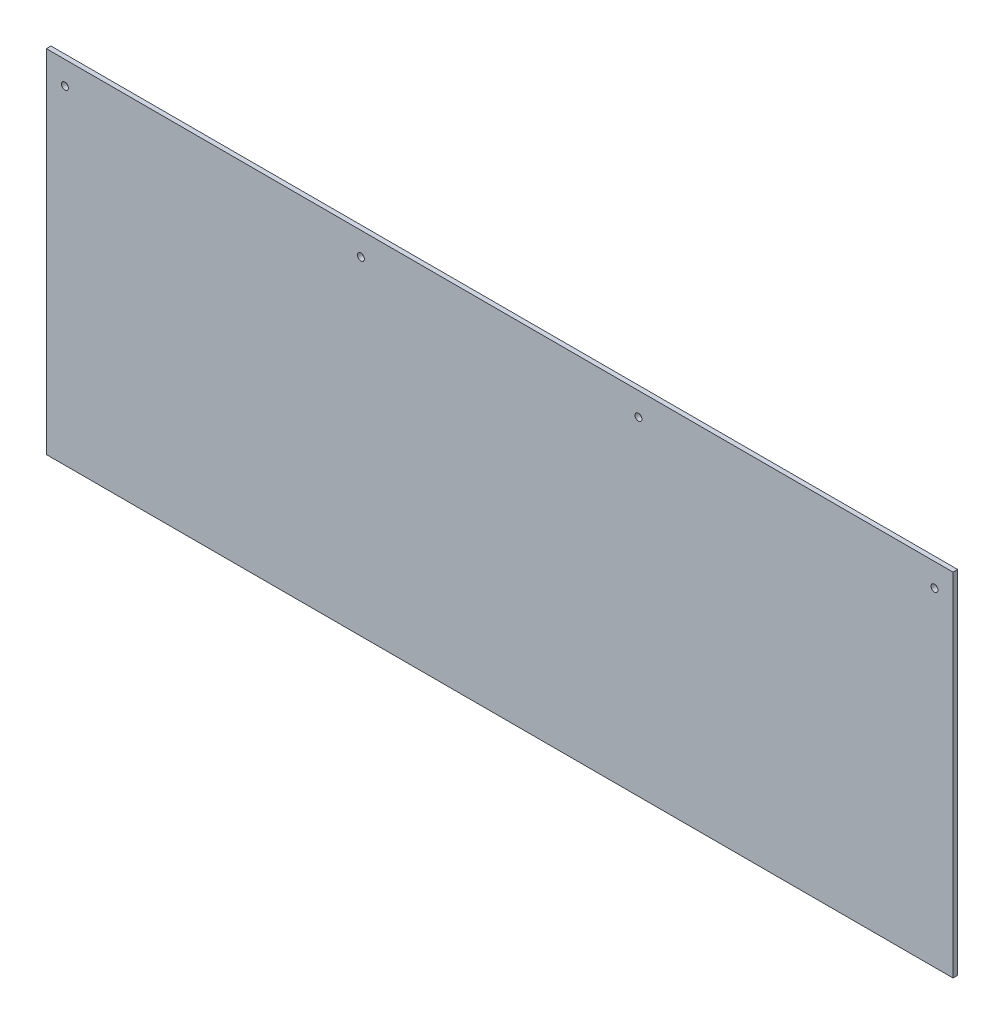
ISO-10303-21;
HEADER;
FILE_DESCRIPTION(('STEP AP214'),'2;1');
FILE_NAME('part.step','',(''),(''),'','','');
FILE_SCHEMA(('AUTOMOTIVE_DESIGN { 1 0 10303 214 1 1 1 1 }'));
ENDSEC;
DATA;
#1=APPLICATION_CONTEXT('core data for automotive mechanical design processes');
#2=APPLICATION_PROTOCOL_DEFINITION('international standard','automotive_design',2000,#1);
#3=PRODUCT_CONTEXT('',#1,'mechanical');
#4=PRODUCT('Part','Part','',(#3));
#5=PRODUCT_RELATED_PRODUCT_CATEGORY('part','',(#4));
#6=PRODUCT_DEFINITION_FORMATION('','',#4);
#7=PRODUCT_DEFINITION_CONTEXT('part definition',#1,'design');
#8=PRODUCT_DEFINITION('design','',#6,#7);
#9=PRODUCT_DEFINITION_SHAPE('','',#8);
#10=(LENGTH_UNIT() NAMED_UNIT(*) SI_UNIT(.MILLI.,.METRE.));
#11=(NAMED_UNIT(*) PLANE_ANGLE_UNIT() SI_UNIT($,.RADIAN.));
#12=(NAMED_UNIT(*) SI_UNIT($,.STERADIAN.) SOLID_ANGLE_UNIT());
#13=UNCERTAINTY_MEASURE_WITH_UNIT(LENGTH_MEASURE(1.E-05),#10,'distance_accuracy_value','');
#14=(GEOMETRIC_REPRESENTATION_CONTEXT(3) GLOBAL_UNCERTAINTY_ASSIGNED_CONTEXT((#13)) GLOBAL_UNIT_ASSIGNED_CONTEXT((#10,
#11,#12)) REPRESENTATION_CONTEXT('',''));
#15=CARTESIAN_POINT('',(0.,0.,0.));
#16=DIRECTION('',(0.,0.,1.));
#17=DIRECTION('',(1.,0.,0.));
#18=AXIS2_PLACEMENT_3D('',#15,#16,#17);
#19=CARTESIAN_POINT('',(0.,0.,6.35));
#20=DIRECTION('',(1.,0.,0.));
#21=DIRECTION('',(0.,0.,-1.));
#22=AXIS2_PLACEMENT_3D('',#19,#20,#21);
#23=PLANE('',#22);
#24=DIRECTION('',(0.,-1.,0.));
#25=VECTOR('',#24,1.);
#26=CARTESIAN_POINT('',(0.,0.,0.));
#27=LINE('',#26,#25);
#28=CARTESIAN_POINT('',(0.,482.6,0.));
#29=VERTEX_POINT('',#28);
#30=CARTESIAN_POINT('',(0.,0.,0.));
#31=VERTEX_POINT('',#30);
#32=EDGE_CURVE('E97',#29,#31,#27,.T.);
#33=ORIENTED_EDGE('',*,*,#32,.T.);
#34=DIRECTION('',(0.,0.,-1.));
#35=VECTOR('',#34,1.);
#36=CARTESIAN_POINT('',(0.,0.,6.35));
#37=LINE('',#36,#35);
#38=CARTESIAN_POINT('',(0.,0.,6.35));
#39=VERTEX_POINT('',#38);
#40=EDGE_CURVE('E11',#39,#31,#37,.T.);
#41=ORIENTED_EDGE('',*,*,#40,.F.);
#42=DIRECTION('',(0.,-1.,0.));
#43=VECTOR('',#42,1.);
#44=CARTESIAN_POINT('',(0.,0.,6.35));
#45=LINE('',#44,#43);
#46=CARTESIAN_POINT('',(0.,482.6,6.35));
#47=VERTEX_POINT('',#46);
#48=EDGE_CURVE('E85',#47,#39,#45,.T.);
#49=ORIENTED_EDGE('',*,*,#48,.F.);
#50=DIRECTION('',(0.,0.,-1.));
#51=VECTOR('',#50,1.);
#52=CARTESIAN_POINT('',(0.,482.6,6.35));
#53=LINE('',#52,#51);
#54=EDGE_CURVE('E93',#47,#29,#53,.T.);
#55=ORIENTED_EDGE('',*,*,#54,.T.);
#56=EDGE_LOOP('',(#33,#41,#49,#55));
#57=FACE_BOUND('',#56,.T.);
#58=ADVANCED_FACE('F34',(#57),#23,.F.);
#59=CARTESIAN_POINT('',(0.,0.,6.35));
#60=DIRECTION('',(0.,1.,0.));
#61=DIRECTION('',(0.,0.,1.));
#62=AXIS2_PLACEMENT_3D('',#59,#60,#61);
#63=PLANE('',#62);
#64=DIRECTION('',(1.,0.,0.));
#65=VECTOR('',#64,1.);
#66=CARTESIAN_POINT('',(0.,0.,0.));
#67=LINE('',#66,#65);
#68=CARTESIAN_POINT('',(1244.6,0.,0.));
#69=VERTEX_POINT('',#68);
#70=EDGE_CURVE('E89',#31,#69,#67,.T.);
#71=ORIENTED_EDGE('',*,*,#70,.T.);
#72=DIRECTION('',(0.,0.,-1.));
#73=VECTOR('',#72,1.);
#74=CARTESIAN_POINT('',(1244.6,0.,6.35));
#75=LINE('',#74,#73);
#76=CARTESIAN_POINT('',(1244.6,0.,6.35));
#77=VERTEX_POINT('',#76);
#78=EDGE_CURVE('E42',#77,#69,#75,.T.);
#79=ORIENTED_EDGE('',*,*,#78,.F.);
#80=DIRECTION('',(1.,0.,0.));
#81=VECTOR('',#80,1.);
#82=CARTESIAN_POINT('',(0.,0.,6.35));
#83=LINE('',#82,#81);
#84=EDGE_CURVE('E80',#39,#77,#83,.T.);
#85=ORIENTED_EDGE('',*,*,#84,.F.);
#86=ORIENTED_EDGE('',*,*,#40,.T.);
#87=EDGE_LOOP('',(#71,#79,#85,#86));
#88=FACE_BOUND('',#87,.T.);
#89=ADVANCED_FACE('F88',(#88),#63,.F.);
#90=CARTESIAN_POINT('',(1244.6,0.,6.35));
#91=DIRECTION('',(-1.,0.,0.));
#92=DIRECTION('',(0.,0.,1.));
#93=AXIS2_PLACEMENT_3D('',#90,#91,#92);
#94=PLANE('',#93);
#95=DIRECTION('',(0.,1.,0.));
#96=VECTOR('',#95,1.);
#97=CARTESIAN_POINT('',(1244.6,0.,0.));
#98=LINE('',#97,#96);
#99=CARTESIAN_POINT('',(1244.6,482.6,0.));
#100=VERTEX_POINT('',#99);
#101=EDGE_CURVE('E67',#69,#100,#98,.T.);
#102=ORIENTED_EDGE('',*,*,#101,.T.);
#103=DIRECTION('',(0.,0.,-1.));
#104=VECTOR('',#103,1.);
#105=CARTESIAN_POINT('',(1244.6,482.6,6.35));
#106=LINE('',#105,#104);
#107=CARTESIAN_POINT('',(1244.6,482.6,6.35));
#108=VERTEX_POINT('',#107);
#109=EDGE_CURVE('E90',#108,#100,#106,.T.);
#110=ORIENTED_EDGE('',*,*,#109,.F.);
#111=DIRECTION('',(0.,1.,0.));
#112=VECTOR('',#111,1.);
#113=CARTESIAN_POINT('',(1244.6,0.,6.35));
#114=LINE('',#113,#112);
#115=EDGE_CURVE('E83',#77,#108,#114,.T.);
#116=ORIENTED_EDGE('',*,*,#115,.F.);
#117=ORIENTED_EDGE('',*,*,#78,.T.);
#118=EDGE_LOOP('',(#102,#110,#116,#117));
#119=FACE_BOUND('',#118,.T.);
#120=ADVANCED_FACE('F91',(#119),#94,.F.);
#121=CARTESIAN_POINT('',(0.,482.6,6.35));
#122=DIRECTION('',(0.,-1.,0.));
#123=DIRECTION('',(1.,0.,0.));
#124=AXIS2_PLACEMENT_3D('',#121,#122,#123);
#125=PLANE('',#124);
#126=DIRECTION('',(-1.,0.,0.));
#127=VECTOR('',#126,1.);
#128=CARTESIAN_POINT('',(0.,482.6,0.));
#129=LINE('',#128,#127);
#130=EDGE_CURVE('E73',#100,#29,#129,.T.);
#131=ORIENTED_EDGE('',*,*,#130,.T.);
#132=ORIENTED_EDGE('',*,*,#54,.F.);
#133=DIRECTION('',(-1.,0.,0.));
#134=VECTOR('',#133,1.);
#135=CARTESIAN_POINT('',(0.,482.6,6.35));
#136=LINE('',#135,#134);
#137=EDGE_CURVE('E50',#108,#47,#136,.T.);
#138=ORIENTED_EDGE('',*,*,#137,.F.);
#139=ORIENTED_EDGE('',*,*,#109,.T.);
#140=EDGE_LOOP('',(#131,#132,#138,#139));
#141=FACE_BOUND('',#140,.T.);
#142=ADVANCED_FACE('F105',(#141),#125,.F.);
#143=CARTESIAN_POINT('',(0.,0.,6.35));
#144=DIRECTION('',(0.,0.,-1.));
#145=DIRECTION('',(-1.,0.,0.));
#146=AXIS2_PLACEMENT_3D('',#143,#144,#145);
#147=PLANE('',#146);
#148=CARTESIAN_POINT('',(25.4,450.85,6.35));
#149=DIRECTION('',(0.,0.,1.));
#150=DIRECTION('',(1.,0.,0.));
#151=AXIS2_PLACEMENT_3D('',#148,#149,#150);
#152=CIRCLE('',#151,4.7625);
#153=CARTESIAN_POINT('',(30.1625,450.85,6.35));
#154=VERTEX_POINT('',#153);
#155=EDGE_CURVE('E129',#154,#154,#152,.T.);
#156=ORIENTED_EDGE('',*,*,#155,.F.);
#157=EDGE_LOOP('',(#156));
#158=FACE_BOUND('',#157,.T.);
#159=CARTESIAN_POINT('',(431.8,450.85,6.35));
#160=DIRECTION('',(0.,0.,1.));
#161=DIRECTION('',(1.,0.,0.));
#162=AXIS2_PLACEMENT_3D('',#159,#160,#161);
#163=CIRCLE('',#162,4.76250000000001);
#164=CARTESIAN_POINT('',(436.5625,450.85,6.35));
#165=VERTEX_POINT('',#164);
#166=EDGE_CURVE('E123',#165,#165,#163,.T.);
#167=ORIENTED_EDGE('',*,*,#166,.F.);
#168=EDGE_LOOP('',(#167));
#169=FACE_BOUND('',#168,.T.);
#170=CARTESIAN_POINT('',(812.8,450.85,6.35));
#171=DIRECTION('',(0.,0.,1.));
#172=DIRECTION('',(1.,0.,0.));
#173=AXIS2_PLACEMENT_3D('',#170,#171,#172);
#174=CIRCLE('',#173,4.76250000000001);
#175=CARTESIAN_POINT('',(817.5625,450.85,6.35));
#176=VERTEX_POINT('',#175);
#177=EDGE_CURVE('E117',#176,#176,#174,.T.);
#178=ORIENTED_EDGE('',*,*,#177,.F.);
#179=EDGE_LOOP('',(#178));
#180=FACE_BOUND('',#179,.T.);
#181=CARTESIAN_POINT('',(1219.2,450.85,6.35));
#182=DIRECTION('',(0.,0.,1.));
#183=DIRECTION('',(1.,0.,0.));
#184=AXIS2_PLACEMENT_3D('',#181,#182,#183);
#185=CIRCLE('',#184,4.7624999999999);
#186=CARTESIAN_POINT('',(1223.9625,450.85,6.35));
#187=VERTEX_POINT('',#186);
#188=EDGE_CURVE('E111',#187,#187,#185,.T.);
#189=ORIENTED_EDGE('',*,*,#188,.F.);
#190=EDGE_LOOP('',(#189));
#191=FACE_BOUND('',#190,.T.);
#192=ORIENTED_EDGE('',*,*,#48,.T.);
#193=ORIENTED_EDGE('',*,*,#84,.T.);
#194=ORIENTED_EDGE('',*,*,#115,.T.);
#195=ORIENTED_EDGE('',*,*,#137,.T.);
#196=EDGE_LOOP('',(#192,#193,#194,#195));
#197=FACE_BOUND('',#196,.T.);
#198=ADVANCED_FACE('F81',(#158,#169,#180,#191,#197),#147,.F.);
#199=CARTESIAN_POINT('',(0.,0.,0.));
#200=DIRECTION('',(0.,0.,-1.));
#201=DIRECTION('',(-1.,0.,0.));
#202=AXIS2_PLACEMENT_3D('',#199,#200,#201);
#203=PLANE('',#202);
#204=CARTESIAN_POINT('',(25.4,450.85,0.));
#205=DIRECTION('',(0.,0.,1.));
#206=DIRECTION('',(1.,0.,0.));
#207=AXIS2_PLACEMENT_3D('',#204,#205,#206);
#208=CIRCLE('',#207,4.7625);
#209=CARTESIAN_POINT('',(30.1625,450.85,0.));
#210=VERTEX_POINT('',#209);
#211=EDGE_CURVE('E100',#210,#210,#208,.T.);
#212=ORIENTED_EDGE('',*,*,#211,.T.);
#213=EDGE_LOOP('',(#212));
#214=FACE_BOUND('',#213,.T.);
#215=CARTESIAN_POINT('',(431.8,450.85,0.));
#216=DIRECTION('',(0.,0.,1.));
#217=DIRECTION('',(1.,0.,0.));
#218=AXIS2_PLACEMENT_3D('',#215,#216,#217);
#219=CIRCLE('',#218,4.76250000000001);
#220=CARTESIAN_POINT('',(436.5625,450.85,0.));
#221=VERTEX_POINT('',#220);
#222=EDGE_CURVE('E126',#221,#221,#219,.T.);
#223=ORIENTED_EDGE('',*,*,#222,.T.);
#224=EDGE_LOOP('',(#223));
#225=FACE_BOUND('',#224,.T.);
#226=CARTESIAN_POINT('',(812.8,450.85,0.));
#227=DIRECTION('',(0.,0.,1.));
#228=DIRECTION('',(1.,0.,0.));
#229=AXIS2_PLACEMENT_3D('',#226,#227,#228);
#230=CIRCLE('',#229,4.76250000000001);
#231=CARTESIAN_POINT('',(817.5625,450.85,0.));
#232=VERTEX_POINT('',#231);
#233=EDGE_CURVE('E120',#232,#232,#230,.T.);
#234=ORIENTED_EDGE('',*,*,#233,.T.);
#235=EDGE_LOOP('',(#234));
#236=FACE_BOUND('',#235,.T.);
#237=CARTESIAN_POINT('',(1219.2,450.85,0.));
#238=DIRECTION('',(0.,0.,1.));
#239=DIRECTION('',(1.,0.,0.));
#240=AXIS2_PLACEMENT_3D('',#237,#238,#239);
#241=CIRCLE('',#240,4.7624999999999);
#242=CARTESIAN_POINT('',(1223.9625,450.85,0.));
#243=VERTEX_POINT('',#242);
#244=EDGE_CURVE('E114',#243,#243,#241,.T.);
#245=ORIENTED_EDGE('',*,*,#244,.T.);
#246=EDGE_LOOP('',(#245));
#247=FACE_BOUND('',#246,.T.);
#248=ORIENTED_EDGE('',*,*,#32,.F.);
#249=ORIENTED_EDGE('',*,*,#130,.F.);
#250=ORIENTED_EDGE('',*,*,#101,.F.);
#251=ORIENTED_EDGE('',*,*,#70,.F.);
#252=EDGE_LOOP('',(#248,#249,#250,#251));
#253=FACE_BOUND('',#252,.T.);
#254=ADVANCED_FACE('F108',(#214,#225,#236,#247,#253),#203,.T.);
#255=CARTESIAN_POINT('',(1219.2,450.85,0.));
#256=DIRECTION('',(0.,0.,1.));
#257=DIRECTION('',(1.,0.,0.));
#258=AXIS2_PLACEMENT_3D('',#255,#256,#257);
#259=CYLINDRICAL_SURFACE('',#258,4.7624999999999);
#260=ORIENTED_EDGE('',*,*,#244,.F.);
#261=EDGE_LOOP('',(#260));
#262=FACE_BOUND('',#261,.T.);
#263=ORIENTED_EDGE('',*,*,#188,.T.);
#264=EDGE_LOOP('',(#263));
#265=FACE_BOUND('',#264,.T.);
#266=ADVANCED_FACE('F153',(#262,#265),#259,.F.);
#267=CARTESIAN_POINT('',(812.8,450.85,0.));
#268=DIRECTION('',(0.,0.,1.));
#269=DIRECTION('',(1.,0.,0.));
#270=AXIS2_PLACEMENT_3D('',#267,#268,#269);
#271=CYLINDRICAL_SURFACE('',#270,4.76250000000001);
#272=ORIENTED_EDGE('',*,*,#233,.F.);
#273=EDGE_LOOP('',(#272));
#274=FACE_BOUND('',#273,.T.);
#275=ORIENTED_EDGE('',*,*,#177,.T.);
#276=EDGE_LOOP('',(#275));
#277=FACE_BOUND('',#276,.T.);
#278=ADVANCED_FACE('F155',(#274,#277),#271,.F.);
#279=CARTESIAN_POINT('',(431.8,450.85,0.));
#280=DIRECTION('',(0.,0.,1.));
#281=DIRECTION('',(1.,0.,0.));
#282=AXIS2_PLACEMENT_3D('',#279,#280,#281);
#283=CYLINDRICAL_SURFACE('',#282,4.76250000000001);
#284=ORIENTED_EDGE('',*,*,#222,.F.);
#285=EDGE_LOOP('',(#284));
#286=FACE_BOUND('',#285,.T.);
#287=ORIENTED_EDGE('',*,*,#166,.T.);
#288=EDGE_LOOP('',(#287));
#289=FACE_BOUND('',#288,.T.);
#290=ADVANCED_FACE('F140',(#286,#289),#283,.F.);
#291=CARTESIAN_POINT('',(25.4,450.85,0.));
#292=DIRECTION('',(0.,0.,1.));
#293=DIRECTION('',(1.,0.,0.));
#294=AXIS2_PLACEMENT_3D('',#291,#292,#293);
#295=CYLINDRICAL_SURFACE('',#294,4.7625);
#296=ORIENTED_EDGE('',*,*,#211,.F.);
#297=EDGE_LOOP('',(#296));
#298=FACE_BOUND('',#297,.T.);
#299=ORIENTED_EDGE('',*,*,#155,.T.);
#300=EDGE_LOOP('',(#299));
#301=FACE_BOUND('',#300,.T.);
#302=ADVANCED_FACE('F137',(#298,#301),#295,.F.);
#303=CLOSED_SHELL('',(#58,#89,#120,#142,#198,#254,#266,#278,#290,#302));
#304=MANIFOLD_SOLID_BREP('B2',#303);
#305=ADVANCED_BREP_SHAPE_REPRESENTATION('',(#18,#304),#14);
#306=SHAPE_DEFINITION_REPRESENTATION(#9,#305);
ENDSEC;
END-ISO-10303-21;
